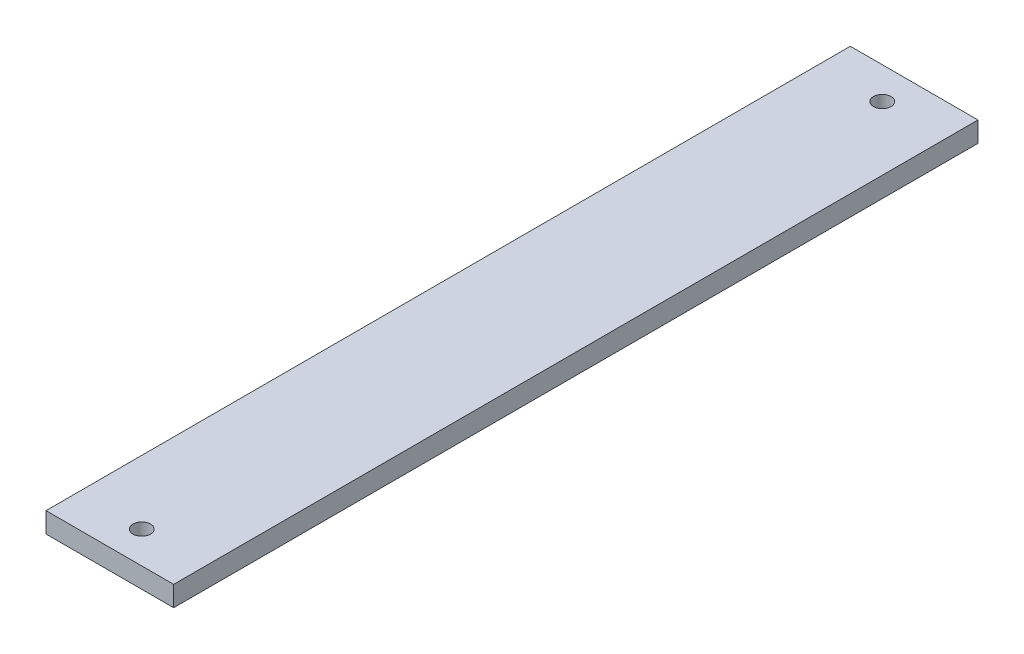
ISO-10303-21;
HEADER;
FILE_DESCRIPTION(('STEP AP214'),'2;1');
FILE_NAME('part.step','',(''),(''),'','','');
FILE_SCHEMA(('AUTOMOTIVE_DESIGN { 1 0 10303 214 1 1 1 1 }'));
ENDSEC;
DATA;
#1=APPLICATION_CONTEXT('core data for automotive mechanical design processes');
#2=APPLICATION_PROTOCOL_DEFINITION('international standard','automotive_design',2000,#1);
#3=PRODUCT_CONTEXT('',#1,'mechanical');
#4=PRODUCT('Part','Part','',(#3));
#5=PRODUCT_RELATED_PRODUCT_CATEGORY('part','',(#4));
#6=PRODUCT_DEFINITION_FORMATION('','',#4);
#7=PRODUCT_DEFINITION_CONTEXT('part definition',#1,'design');
#8=PRODUCT_DEFINITION('design','',#6,#7);
#9=PRODUCT_DEFINITION_SHAPE('','',#8);
#10=(LENGTH_UNIT() NAMED_UNIT(*) SI_UNIT(.MILLI.,.METRE.));
#11=(NAMED_UNIT(*) PLANE_ANGLE_UNIT() SI_UNIT($,.RADIAN.));
#12=(NAMED_UNIT(*) SI_UNIT($,.STERADIAN.) SOLID_ANGLE_UNIT());
#13=UNCERTAINTY_MEASURE_WITH_UNIT(LENGTH_MEASURE(1.E-05),#10,'distance_accuracy_value','');
#14=(GEOMETRIC_REPRESENTATION_CONTEXT(3) GLOBAL_UNCERTAINTY_ASSIGNED_CONTEXT((#13)) GLOBAL_UNIT_ASSIGNED_CONTEXT((#10,
#11,#12)) REPRESENTATION_CONTEXT('',''));
#15=CARTESIAN_POINT('',(0.,0.,0.));
#16=DIRECTION('',(0.,0.,1.));
#17=DIRECTION('',(1.,0.,0.));
#18=AXIS2_PLACEMENT_3D('',#15,#16,#17);
#19=CARTESIAN_POINT('',(0.,6.35,126.));
#20=DIRECTION('',(0.,0.,-1.));
#21=DIRECTION('',(-1.,0.,0.));
#22=AXIS2_PLACEMENT_3D('',#19,#20,#21);
#23=PLANE('',#22);
#24=DIRECTION('',(1.,0.,0.));
#25=VECTOR('',#24,1.);
#26=CARTESIAN_POINT('',(0.,0.,126.));
#27=LINE('',#26,#25);
#28=CARTESIAN_POINT('',(-20.,0.,126.));
#29=VERTEX_POINT('',#28);
#30=CARTESIAN_POINT('',(20.,0.,126.));
#31=VERTEX_POINT('',#30);
#32=EDGE_CURVE('E119',#29,#31,#27,.T.);
#33=ORIENTED_EDGE('',*,*,#32,.T.);
#34=DIRECTION('',(0.,-1.,0.));
#35=VECTOR('',#34,1.);
#36=CARTESIAN_POINT('',(20.,6.35,126.));
#37=LINE('',#36,#35);
#38=CARTESIAN_POINT('',(20.,6.35,126.));
#39=VERTEX_POINT('',#38);
#40=EDGE_CURVE('E11',#39,#31,#37,.T.);
#41=ORIENTED_EDGE('',*,*,#40,.F.);
#42=DIRECTION('',(1.,0.,0.));
#43=VECTOR('',#42,1.);
#44=CARTESIAN_POINT('',(0.,6.35,126.));
#45=LINE('',#44,#43);
#46=CARTESIAN_POINT('',(-20.,6.35,126.));
#47=VERTEX_POINT('',#46);
#48=EDGE_CURVE('E93',#47,#39,#45,.T.);
#49=ORIENTED_EDGE('',*,*,#48,.F.);
#50=DIRECTION('',(0.,-1.,0.));
#51=VECTOR('',#50,1.);
#52=CARTESIAN_POINT('',(-20.,6.35,126.));
#53=LINE('',#52,#51);
#54=EDGE_CURVE('E60',#47,#29,#53,.T.);
#55=ORIENTED_EDGE('',*,*,#54,.T.);
#56=EDGE_LOOP('',(#33,#41,#49,#55));
#57=FACE_BOUND('',#56,.T.);
#58=ADVANCED_FACE('F42',(#57),#23,.F.);
#59=CARTESIAN_POINT('',(20.,6.35,0.));
#60=DIRECTION('',(-1.,0.,0.));
#61=DIRECTION('',(0.,0.,1.));
#62=AXIS2_PLACEMENT_3D('',#59,#60,#61);
#63=PLANE('',#62);
#64=DIRECTION('',(0.,0.,-1.));
#65=VECTOR('',#64,1.);
#66=CARTESIAN_POINT('',(20.,0.,0.));
#67=LINE('',#66,#65);
#68=CARTESIAN_POINT('',(20.,0.,-126.));
#69=VERTEX_POINT('',#68);
#70=EDGE_CURVE('E99',#31,#69,#67,.T.);
#71=ORIENTED_EDGE('',*,*,#70,.T.);
#72=DIRECTION('',(0.,-1.,0.));
#73=VECTOR('',#72,1.);
#74=CARTESIAN_POINT('',(20.,6.35,-126.));
#75=LINE('',#74,#73);
#76=CARTESIAN_POINT('',(20.,6.35,-126.));
#77=VERTEX_POINT('',#76);
#78=EDGE_CURVE('E52',#77,#69,#75,.T.);
#79=ORIENTED_EDGE('',*,*,#78,.F.);
#80=DIRECTION('',(0.,0.,-1.));
#81=VECTOR('',#80,1.);
#82=CARTESIAN_POINT('',(20.,6.35,0.));
#83=LINE('',#82,#81);
#84=EDGE_CURVE('E85',#39,#77,#83,.T.);
#85=ORIENTED_EDGE('',*,*,#84,.F.);
#86=ORIENTED_EDGE('',*,*,#40,.T.);
#87=EDGE_LOOP('',(#71,#79,#85,#86));
#88=FACE_BOUND('',#87,.T.);
#89=ADVANCED_FACE('F98',(#88),#63,.F.);
#90=CARTESIAN_POINT('',(0.,6.35,-126.));
#91=DIRECTION('',(0.,0.,-1.));
#92=DIRECTION('',(-1.,0.,0.));
#93=AXIS2_PLACEMENT_3D('',#90,#91,#92);
#94=PLANE('',#93);
#95=DIRECTION('',(1.,0.,0.));
#96=VECTOR('',#95,1.);
#97=CARTESIAN_POINT('',(0.,0.,-126.));
#98=LINE('',#97,#96);
#99=CARTESIAN_POINT('',(-20.,0.,-126.));
#100=VERTEX_POINT('',#99);
#101=EDGE_CURVE('E124',#100,#69,#98,.T.);
#102=ORIENTED_EDGE('',*,*,#101,.F.);
#103=DIRECTION('',(0.,-1.,0.));
#104=VECTOR('',#103,1.);
#105=CARTESIAN_POINT('',(-20.,6.35,-126.));
#106=LINE('',#105,#104);
#107=CARTESIAN_POINT('',(-20.,6.35,-126.));
#108=VERTEX_POINT('',#107);
#109=EDGE_CURVE('E74',#108,#100,#106,.T.);
#110=ORIENTED_EDGE('',*,*,#109,.F.);
#111=DIRECTION('',(1.,0.,0.));
#112=VECTOR('',#111,1.);
#113=CARTESIAN_POINT('',(0.,6.35,-126.));
#114=LINE('',#113,#112);
#115=EDGE_CURVE('E92',#108,#77,#114,.T.);
#116=ORIENTED_EDGE('',*,*,#115,.T.);
#117=ORIENTED_EDGE('',*,*,#78,.T.);
#118=EDGE_LOOP('',(#102,#110,#116,#117));
#119=FACE_BOUND('',#118,.T.);
#120=ADVANCED_FACE('F103',(#119),#94,.T.);
#121=CARTESIAN_POINT('',(0.,6.35,-116.));
#122=DIRECTION('',(0.,-1.,0.));
#123=DIRECTION('',(0.,0.,-1.));
#124=AXIS2_PLACEMENT_3D('',#121,#122,#123);
#125=CYLINDRICAL_SURFACE('',#124,2.75);
#126=CARTESIAN_POINT('',(0.,6.35,-116.));
#127=DIRECTION('',(0.,1.,0.));
#128=DIRECTION('',(0.,0.,1.));
#129=AXIS2_PLACEMENT_3D('',#126,#127,#128);
#130=CIRCLE('',#129,2.75);
#131=CARTESIAN_POINT('',(0.,6.35,-113.25));
#132=VERTEX_POINT('',#131);
#133=EDGE_CURVE('E138',#132,#132,#130,.T.);
#134=ORIENTED_EDGE('',*,*,#133,.T.);
#135=EDGE_LOOP('',(#134));
#136=FACE_BOUND('',#135,.T.);
#137=CARTESIAN_POINT('',(0.,0.,-116.));
#138=DIRECTION('',(0.,1.,0.));
#139=DIRECTION('',(0.,0.,1.));
#140=AXIS2_PLACEMENT_3D('',#137,#138,#139);
#141=CIRCLE('',#140,2.75);
#142=CARTESIAN_POINT('',(0.,0.,-113.25));
#143=VERTEX_POINT('',#142);
#144=EDGE_CURVE('E115',#143,#143,#141,.T.);
#145=ORIENTED_EDGE('',*,*,#144,.F.);
#146=EDGE_LOOP('',(#145));
#147=FACE_BOUND('',#146,.T.);
#148=ADVANCED_FACE('F148',(#136,#147),#125,.F.);
#149=CARTESIAN_POINT('',(0.,6.35,116.));
#150=DIRECTION('',(0.,-1.,0.));
#151=DIRECTION('',(0.,0.,-1.));
#152=AXIS2_PLACEMENT_3D('',#149,#150,#151);
#153=CYLINDRICAL_SURFACE('',#152,2.75);
#154=CARTESIAN_POINT('',(0.,6.35,116.));
#155=DIRECTION('',(0.,1.,0.));
#156=DIRECTION('',(0.,0.,1.));
#157=AXIS2_PLACEMENT_3D('',#154,#155,#156);
#158=CIRCLE('',#157,2.75);
#159=CARTESIAN_POINT('',(0.,6.35,118.75));
#160=VERTEX_POINT('',#159);
#161=EDGE_CURVE('E131',#160,#160,#158,.T.);
#162=ORIENTED_EDGE('',*,*,#161,.T.);
#163=EDGE_LOOP('',(#162));
#164=FACE_BOUND('',#163,.T.);
#165=CARTESIAN_POINT('',(0.,0.,116.));
#166=DIRECTION('',(0.,1.,0.));
#167=DIRECTION('',(0.,0.,1.));
#168=AXIS2_PLACEMENT_3D('',#165,#166,#167);
#169=CIRCLE('',#168,2.75);
#170=CARTESIAN_POINT('',(0.,0.,118.75));
#171=VERTEX_POINT('',#170);
#172=EDGE_CURVE('E111',#171,#171,#169,.T.);
#173=ORIENTED_EDGE('',*,*,#172,.F.);
#174=EDGE_LOOP('',(#173));
#175=FACE_BOUND('',#174,.T.);
#176=ADVANCED_FACE('F44',(#164,#175),#153,.F.);
#177=CARTESIAN_POINT('',(-20.,6.35,0.));
#178=DIRECTION('',(-1.,0.,0.));
#179=DIRECTION('',(0.,0.,1.));
#180=AXIS2_PLACEMENT_3D('',#177,#178,#179);
#181=PLANE('',#180);
#182=DIRECTION('',(0.,0.,-1.));
#183=VECTOR('',#182,1.);
#184=CARTESIAN_POINT('',(-20.,0.,0.));
#185=LINE('',#184,#183);
#186=EDGE_CURVE('E127',#29,#100,#185,.T.);
#187=ORIENTED_EDGE('',*,*,#186,.F.);
#188=ORIENTED_EDGE('',*,*,#54,.F.);
#189=DIRECTION('',(0.,0.,-1.));
#190=VECTOR('',#189,1.);
#191=CARTESIAN_POINT('',(-20.,6.35,0.));
#192=LINE('',#191,#190);
#193=EDGE_CURVE('E105',#47,#108,#192,.T.);
#194=ORIENTED_EDGE('',*,*,#193,.T.);
#195=ORIENTED_EDGE('',*,*,#109,.T.);
#196=EDGE_LOOP('',(#187,#188,#194,#195));
#197=FACE_BOUND('',#196,.T.);
#198=ADVANCED_FACE('F153',(#197),#181,.T.);
#199=CARTESIAN_POINT('',(0.,6.35,0.));
#200=DIRECTION('',(0.,1.,0.));
#201=DIRECTION('',(0.,0.,1.));
#202=AXIS2_PLACEMENT_3D('',#199,#200,#201);
#203=PLANE('',#202);
#204=ORIENTED_EDGE('',*,*,#161,.F.);
#205=EDGE_LOOP('',(#204));
#206=FACE_BOUND('',#205,.T.);
#207=ORIENTED_EDGE('',*,*,#133,.F.);
#208=EDGE_LOOP('',(#207));
#209=FACE_BOUND('',#208,.T.);
#210=ORIENTED_EDGE('',*,*,#48,.T.);
#211=ORIENTED_EDGE('',*,*,#84,.T.);
#212=ORIENTED_EDGE('',*,*,#115,.F.);
#213=ORIENTED_EDGE('',*,*,#193,.F.);
#214=EDGE_LOOP('',(#210,#211,#212,#213));
#215=FACE_BOUND('',#214,.T.);
#216=ADVANCED_FACE('F89',(#206,#209,#215),#203,.T.);
#217=CARTESIAN_POINT('',(0.,0.,0.));
#218=DIRECTION('',(0.,1.,0.));
#219=DIRECTION('',(0.,0.,1.));
#220=AXIS2_PLACEMENT_3D('',#217,#218,#219);
#221=PLANE('',#220);
#222=ORIENTED_EDGE('',*,*,#172,.T.);
#223=EDGE_LOOP('',(#222));
#224=FACE_BOUND('',#223,.T.);
#225=ORIENTED_EDGE('',*,*,#144,.T.);
#226=EDGE_LOOP('',(#225));
#227=FACE_BOUND('',#226,.T.);
#228=ORIENTED_EDGE('',*,*,#32,.F.);
#229=ORIENTED_EDGE('',*,*,#186,.T.);
#230=ORIENTED_EDGE('',*,*,#101,.T.);
#231=ORIENTED_EDGE('',*,*,#70,.F.);
#232=EDGE_LOOP('',(#228,#229,#230,#231));
#233=FACE_BOUND('',#232,.T.);
#234=ADVANCED_FACE('F152',(#224,#227,#233),#221,.F.);
#235=CLOSED_SHELL('',(#58,#89,#120,#148,#176,#198,#216,#234));
#236=MANIFOLD_SOLID_BREP('B2',#235);
#237=ADVANCED_BREP_SHAPE_REPRESENTATION('',(#18,#236),#14);
#238=SHAPE_DEFINITION_REPRESENTATION(#9,#237);
ENDSEC;
END-ISO-10303-21;
